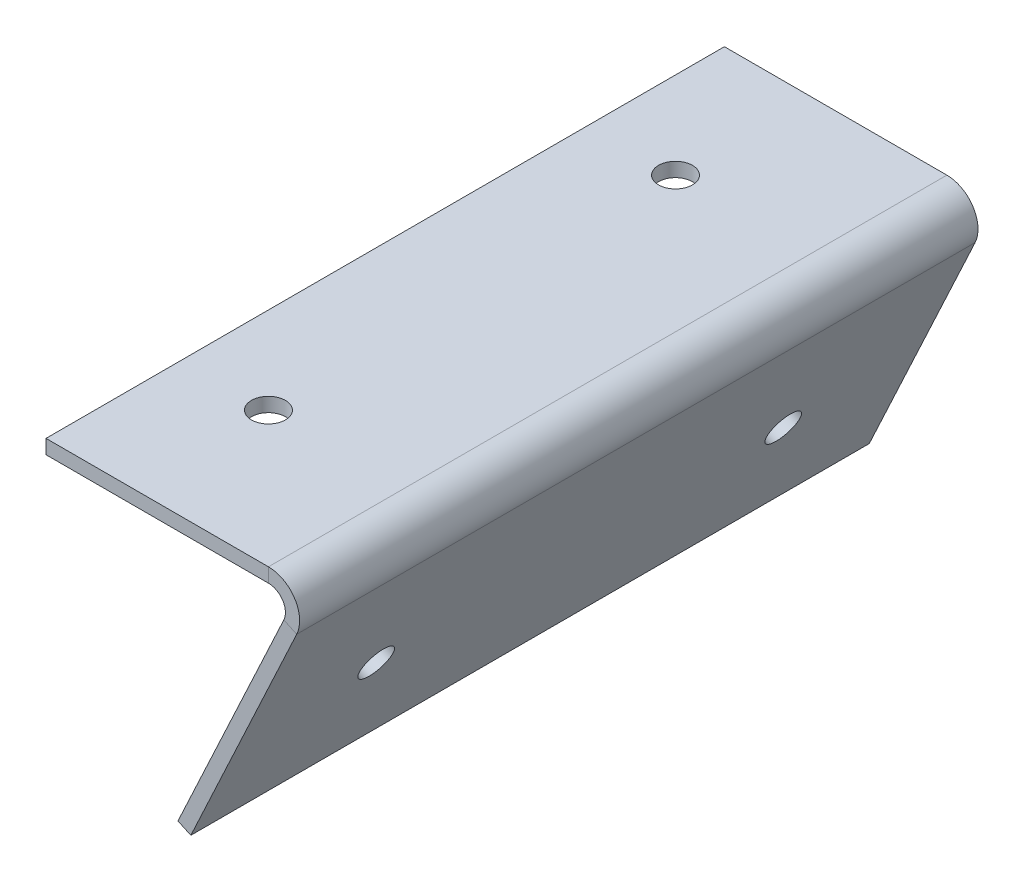
ISO-10303-21;
HEADER;
FILE_DESCRIPTION(('STEP AP214'),'2;1');
FILE_NAME('part.step','',(''),(''),'','','');
FILE_SCHEMA(('AUTOMOTIVE_DESIGN { 1 0 10303 214 1 1 1 1 }'));
ENDSEC;
DATA;
#1=APPLICATION_CONTEXT('core data for automotive mechanical design processes');
#2=APPLICATION_PROTOCOL_DEFINITION('international standard','automotive_design',2000,#1);
#3=PRODUCT_CONTEXT('',#1,'mechanical');
#4=PRODUCT('Part','Part','',(#3));
#5=PRODUCT_RELATED_PRODUCT_CATEGORY('part','',(#4));
#6=PRODUCT_DEFINITION_FORMATION('','',#4);
#7=PRODUCT_DEFINITION_CONTEXT('part definition',#1,'design');
#8=PRODUCT_DEFINITION('design','',#6,#7);
#9=PRODUCT_DEFINITION_SHAPE('','',#8);
#10=(LENGTH_UNIT() NAMED_UNIT(*) SI_UNIT(.MILLI.,.METRE.));
#11=(NAMED_UNIT(*) PLANE_ANGLE_UNIT() SI_UNIT($,.RADIAN.));
#12=(NAMED_UNIT(*) SI_UNIT($,.STERADIAN.) SOLID_ANGLE_UNIT());
#13=UNCERTAINTY_MEASURE_WITH_UNIT(LENGTH_MEASURE(1.E-05),#10,'distance_accuracy_value','');
#14=(GEOMETRIC_REPRESENTATION_CONTEXT(3) GLOBAL_UNCERTAINTY_ASSIGNED_CONTEXT((#13)) GLOBAL_UNIT_ASSIGNED_CONTEXT((#10,
#11,#12)) REPRESENTATION_CONTEXT('',''));
#15=CARTESIAN_POINT('',(0.,0.,0.));
#16=DIRECTION('',(0.,0.,1.));
#17=DIRECTION('',(1.,0.,0.));
#18=AXIS2_PLACEMENT_3D('',#15,#16,#17);
#19=CARTESIAN_POINT('',(46.9312868686949,-8.29648208354991,127.));
#20=DIRECTION('',(0.,0.,1.));
#21=DIRECTION('',(1.,0.,0.));
#22=AXIS2_PLACEMENT_3D('',#19,#20,#21);
#23=PLANE('',#22);
#24=DIRECTION('',(-0.906307787036648,0.422618261740704,0.));
#25=VECTOR('',#24,1.);
#26=CARTESIAN_POINT('',(46.9312868686949,-8.29648208354991,127.));
#27=LINE('',#26,#25);
#28=CARTESIAN_POINT('',(46.9312868686949,-8.29648208354991,127.));
#29=VERTEX_POINT('',#28);
#30=CARTESIAN_POINT('',(44.5233720877844,-7.17365298102673,127.));
#31=VERTEX_POINT('',#30);
#32=EDGE_CURVE('E13',#29,#31,#27,.T.);
#33=ORIENTED_EDGE('',*,*,#32,.F.);
#34=CARTESIAN_POINT('',(41.6458448639431,-5.83184,127.));
#35=DIRECTION('',(0.,0.,1.));
#36=DIRECTION('',(1.,0.,0.));
#37=AXIS2_PLACEMENT_3D('',#34,#35,#36);
#38=CIRCLE('',#37,5.83184);
#39=CARTESIAN_POINT('',(41.6458448639431,0.,127.));
#40=VERTEX_POINT('',#39);
#41=EDGE_CURVE('E150',#40,#29,#38,.F.);
#42=ORIENTED_EDGE('',*,*,#41,.F.);
#43=DIRECTION('',(0.,1.,0.));
#44=VECTOR('',#43,1.);
#45=CARTESIAN_POINT('',(41.6458448639431,-2.65684,127.));
#46=LINE('',#45,#44);
#47=CARTESIAN_POINT('',(41.6458448639431,-2.65684,127.));
#48=VERTEX_POINT('',#47);
#49=EDGE_CURVE('E61',#48,#40,#46,.T.);
#50=ORIENTED_EDGE('',*,*,#49,.F.);
#51=CARTESIAN_POINT('',(41.6458448639431,-5.83184,127.));
#52=DIRECTION('',(0.,0.,1.));
#53=DIRECTION('',(1.,0.,0.));
#54=AXIS2_PLACEMENT_3D('',#51,#52,#53);
#55=CIRCLE('',#54,3.175);
#56=EDGE_CURVE('E143',#48,#31,#55,.F.);
#57=ORIENTED_EDGE('',*,*,#56,.T.);
#58=EDGE_LOOP('',(#33,#42,#50,#57));
#59=FACE_BOUND('',#58,.T.);
#60=ADVANCED_FACE('F53',(#59),#23,.T.);
#61=CARTESIAN_POINT('',(41.6458448639431,-2.65684,127.));
#62=DIRECTION('',(0.,0.,1.));
#63=DIRECTION('',(1.,0.,0.));
#64=AXIS2_PLACEMENT_3D('',#61,#62,#63);
#65=PLANE('',#64);
#66=DIRECTION('',(-0.422618261740704,-0.906307787036648,0.));
#67=VECTOR('',#66,1.);
#68=CARTESIAN_POINT('',(50.8,0.,127.));
#69=LINE('',#68,#67);
#70=CARTESIAN_POINT('',(27.1115709657258,-50.8,127.));
#71=VERTEX_POINT('',#70);
#72=EDGE_CURVE('E200',#29,#71,#69,.T.);
#73=ORIENTED_EDGE('',*,*,#72,.F.);
#74=ORIENTED_EDGE('',*,*,#32,.T.);
#75=DIRECTION('',(-0.422618261740704,-0.906307787036648,0.));
#76=VECTOR('',#75,1.);
#77=CARTESIAN_POINT('',(48.3920852190896,1.12282910252317,127.));
#78=LINE('',#77,#76);
#79=CARTESIAN_POINT('',(24.7036561848153,-49.6771708974768,127.));
#80=VERTEX_POINT('',#79);
#81=EDGE_CURVE('E109',#31,#80,#78,.T.);
#82=ORIENTED_EDGE('',*,*,#81,.T.);
#83=DIRECTION('',(-0.906307787036649,0.422618261740701,0.));
#84=VECTOR('',#83,1.);
#85=CARTESIAN_POINT('',(27.1115709657258,-50.8,127.));
#86=LINE('',#85,#84);
#87=EDGE_CURVE('E432',#71,#80,#86,.T.);
#88=ORIENTED_EDGE('',*,*,#87,.F.);
#89=EDGE_LOOP('',(#73,#74,#82,#88));
#90=FACE_BOUND('',#89,.T.);
#91=ADVANCED_FACE('F208',(#90),#65,.T.);
#92=CARTESIAN_POINT('',(41.6458448639431,0.,0.));
#93=DIRECTION('',(0.,0.,-1.));
#94=DIRECTION('',(-1.,0.,0.));
#95=AXIS2_PLACEMENT_3D('',#92,#93,#94);
#96=PLANE('',#95);
#97=DIRECTION('',(0.,-1.,0.));
#98=VECTOR('',#97,1.);
#99=CARTESIAN_POINT('',(41.6458448639431,0.,0.));
#100=LINE('',#99,#98);
#101=CARTESIAN_POINT('',(41.6458448639431,0.,0.));
#102=VERTEX_POINT('',#101);
#103=CARTESIAN_POINT('',(41.6458448639431,-2.65684,0.));
#104=VERTEX_POINT('',#103);
#105=EDGE_CURVE('E96',#102,#104,#100,.T.);
#106=ORIENTED_EDGE('',*,*,#105,.F.);
#107=CARTESIAN_POINT('',(41.6458448639431,-5.83184,0.));
#108=DIRECTION('',(0.,0.,1.));
#109=DIRECTION('',(1.,0.,0.));
#110=AXIS2_PLACEMENT_3D('',#107,#108,#109);
#111=CIRCLE('',#110,5.83184);
#112=CARTESIAN_POINT('',(46.9312868686949,-8.29648208354991,0.));
#113=VERTEX_POINT('',#112);
#114=EDGE_CURVE('E166',#102,#113,#111,.F.);
#115=ORIENTED_EDGE('',*,*,#114,.T.);
#116=DIRECTION('',(0.906307787036648,-0.422618261740704,0.));
#117=VECTOR('',#116,1.);
#118=CARTESIAN_POINT('',(44.5233720877844,-7.17365298102673,0.));
#119=LINE('',#118,#117);
#120=CARTESIAN_POINT('',(44.5233720877844,-7.17365298102673,0.));
#121=VERTEX_POINT('',#120);
#122=EDGE_CURVE('E103',#121,#113,#119,.T.);
#123=ORIENTED_EDGE('',*,*,#122,.F.);
#124=CARTESIAN_POINT('',(41.6458448639431,-5.83184,0.));
#125=DIRECTION('',(0.,0.,1.));
#126=DIRECTION('',(1.,0.,0.));
#127=AXIS2_PLACEMENT_3D('',#124,#125,#126);
#128=CIRCLE('',#127,3.175);
#129=EDGE_CURVE('E173',#104,#121,#128,.F.);
#130=ORIENTED_EDGE('',*,*,#129,.F.);
#131=EDGE_LOOP('',(#106,#115,#123,#130));
#132=FACE_BOUND('',#131,.T.);
#133=ADVANCED_FACE('F206',(#132),#96,.T.);
#134=CARTESIAN_POINT('',(44.5233720877844,-7.17365298102673,0.));
#135=DIRECTION('',(0.,0.,-1.));
#136=DIRECTION('',(-1.,0.,0.));
#137=AXIS2_PLACEMENT_3D('',#134,#135,#136);
#138=PLANE('',#137);
#139=DIRECTION('',(1.,0.,0.));
#140=VECTOR('',#139,1.);
#141=CARTESIAN_POINT('',(0.,0.,0.));
#142=LINE('',#141,#140);
#143=CARTESIAN_POINT('',(0.,0.,0.));
#144=VERTEX_POINT('',#143);
#145=EDGE_CURVE('E168',#144,#102,#142,.T.);
#146=ORIENTED_EDGE('',*,*,#145,.T.);
#147=ORIENTED_EDGE('',*,*,#105,.T.);
#148=DIRECTION('',(1.,0.,0.));
#149=VECTOR('',#148,1.);
#150=CARTESIAN_POINT('',(0.,-2.65684,0.));
#151=LINE('',#150,#149);
#152=CARTESIAN_POINT('',(0.,-2.65684,0.));
#153=VERTEX_POINT('',#152);
#154=EDGE_CURVE('E171',#153,#104,#151,.T.);
#155=ORIENTED_EDGE('',*,*,#154,.F.);
#156=DIRECTION('',(0.,1.,0.));
#157=VECTOR('',#156,1.);
#158=CARTESIAN_POINT('',(0.,-2.65684,0.));
#159=LINE('',#158,#157);
#160=EDGE_CURVE('E131',#153,#144,#159,.T.);
#161=ORIENTED_EDGE('',*,*,#160,.T.);
#162=EDGE_LOOP('',(#146,#147,#155,#161));
#163=FACE_BOUND('',#162,.T.);
#164=ADVANCED_FACE('F202',(#163),#138,.T.);
#165=CARTESIAN_POINT('',(48.3920852190896,1.12282910252317,127.));
#166=DIRECTION('',(0.906307787036648,-0.422618261740704,0.));
#167=DIRECTION('',(0.422618261740704,0.906307787036648,0.));
#168=AXIS2_PLACEMENT_3D('',#165,#166,#167);
#169=PLANE('',#168);
#170=CARTESIAN_POINT('',(34.0022603893707,-29.7362498297288,101.6));
#171=DIRECTION('',(0.906307787036648,-0.422618261740704,0.));
#172=DIRECTION('',(0.422618261740704,0.906307787036648,0.));
#173=AXIS2_PLACEMENT_3D('',#170,#171,#172);
#174=CIRCLE('',#173,3.175);
#175=CARTESIAN_POINT('',(35.3440733703974,-26.8587226058874,101.6));
#176=VERTEX_POINT('',#175);
#177=EDGE_CURVE('E410',#176,#176,#174,.F.);
#178=ORIENTED_EDGE('',*,*,#177,.F.);
#179=EDGE_LOOP('',(#178));
#180=FACE_BOUND('',#179,.T.);
#181=CARTESIAN_POINT('',(34.0022603893707,-29.7362498297288,25.4));
#182=DIRECTION('',(0.906307787036648,-0.422618261740704,0.));
#183=DIRECTION('',(0.422618261740704,0.906307787036648,0.));
#184=AXIS2_PLACEMENT_3D('',#181,#182,#183);
#185=CIRCLE('',#184,3.175);
#186=CARTESIAN_POINT('',(35.3440733703974,-26.8587226058874,25.4));
#187=VERTEX_POINT('',#186);
#188=EDGE_CURVE('E416',#187,#187,#185,.F.);
#189=ORIENTED_EDGE('',*,*,#188,.F.);
#190=EDGE_LOOP('',(#189));
#191=FACE_BOUND('',#190,.T.);
#192=DIRECTION('',(-0.422618261740704,-0.906307787036648,0.));
#193=VECTOR('',#192,1.);
#194=CARTESIAN_POINT('',(48.3920852190896,1.12282910252317,0.));
#195=LINE('',#194,#193);
#196=CARTESIAN_POINT('',(24.7036561848153,-49.6771708974768,0.));
#197=VERTEX_POINT('',#196);
#198=EDGE_CURVE('E156',#121,#197,#195,.T.);
#199=ORIENTED_EDGE('',*,*,#198,.T.);
#200=DIRECTION('',(0.,0.,-1.));
#201=VECTOR('',#200,1.);
#202=CARTESIAN_POINT('',(24.7036561848153,-49.6771708974768,127.));
#203=LINE('',#202,#201);
#204=EDGE_CURVE('E187',#80,#197,#203,.T.);
#205=ORIENTED_EDGE('',*,*,#204,.F.);
#206=ORIENTED_EDGE('',*,*,#81,.F.);
#207=DIRECTION('',(0.,0.,-1.));
#208=VECTOR('',#207,1.);
#209=CARTESIAN_POINT('',(44.5233720877844,-7.17365298102673,127.));
#210=LINE('',#209,#208);
#211=EDGE_CURVE('E155',#31,#121,#210,.T.);
#212=ORIENTED_EDGE('',*,*,#211,.T.);
#213=EDGE_LOOP('',(#199,#205,#206,#212));
#214=FACE_BOUND('',#213,.T.);
#215=ADVANCED_FACE('F214',(#180,#191,#214),#169,.F.);
#216=CARTESIAN_POINT('',(27.1115709657258,-50.8,127.));
#217=DIRECTION('',(-0.422618261740701,-0.906307787036649,0.));
#218=DIRECTION('',(0.906307787036649,-0.422618261740701,0.));
#219=AXIS2_PLACEMENT_3D('',#216,#217,#218);
#220=PLANE('',#219);
#221=DIRECTION('',(-0.906307787036649,0.422618261740701,0.));
#222=VECTOR('',#221,1.);
#223=CARTESIAN_POINT('',(27.1115709657258,-50.8,0.));
#224=LINE('',#223,#222);
#225=CARTESIAN_POINT('',(27.1115709657258,-50.8,0.));
#226=VERTEX_POINT('',#225);
#227=EDGE_CURVE('E159',#226,#197,#224,.T.);
#228=ORIENTED_EDGE('',*,*,#227,.F.);
#229=DIRECTION('',(0.,0.,-1.));
#230=VECTOR('',#229,1.);
#231=CARTESIAN_POINT('',(27.1115709657258,-50.8,127.));
#232=LINE('',#231,#230);
#233=EDGE_CURVE('E185',#71,#226,#232,.T.);
#234=ORIENTED_EDGE('',*,*,#233,.F.);
#235=ORIENTED_EDGE('',*,*,#87,.T.);
#236=ORIENTED_EDGE('',*,*,#204,.T.);
#237=EDGE_LOOP('',(#228,#234,#235,#236));
#238=FACE_BOUND('',#237,.T.);
#239=ADVANCED_FACE('F243',(#238),#220,.T.);
#240=CARTESIAN_POINT('',(50.8,0.,127.));
#241=DIRECTION('',(0.906307787036648,-0.422618261740704,0.));
#242=DIRECTION('',(0.422618261740704,0.906307787036648,0.));
#243=AXIS2_PLACEMENT_3D('',#240,#241,#242);
#244=PLANE('',#243);
#245=CARTESIAN_POINT('',(36.4101751702812,-30.859078932252,101.6));
#246=DIRECTION('',(0.906307787036648,-0.422618261740704,0.));
#247=DIRECTION('',(0.422618261740704,0.906307787036648,0.));
#248=AXIS2_PLACEMENT_3D('',#245,#246,#247);
#249=CIRCLE('',#248,3.175);
#250=CARTESIAN_POINT('',(37.7519881513079,-27.9815517084106,101.6));
#251=VERTEX_POINT('',#250);
#252=EDGE_CURVE('E407',#251,#251,#249,.T.);
#253=ORIENTED_EDGE('',*,*,#252,.F.);
#254=EDGE_LOOP('',(#253));
#255=FACE_BOUND('',#254,.T.);
#256=CARTESIAN_POINT('',(36.4101751702812,-30.859078932252,25.4));
#257=DIRECTION('',(0.906307787036648,-0.422618261740704,0.));
#258=DIRECTION('',(0.422618261740704,0.906307787036648,0.));
#259=AXIS2_PLACEMENT_3D('',#256,#257,#258);
#260=CIRCLE('',#259,3.175);
#261=CARTESIAN_POINT('',(37.7519881513079,-27.9815517084106,25.4));
#262=VERTEX_POINT('',#261);
#263=EDGE_CURVE('E419',#262,#262,#260,.T.);
#264=ORIENTED_EDGE('',*,*,#263,.F.);
#265=EDGE_LOOP('',(#264));
#266=FACE_BOUND('',#265,.T.);
#267=DIRECTION('',(-0.422618261740704,-0.906307787036648,0.));
#268=VECTOR('',#267,1.);
#269=CARTESIAN_POINT('',(50.8,0.,0.));
#270=LINE('',#269,#268);
#271=EDGE_CURVE('E163',#113,#226,#270,.T.);
#272=ORIENTED_EDGE('',*,*,#271,.F.);
#273=DIRECTION('',(0.,0.,-1.));
#274=VECTOR('',#273,1.);
#275=CARTESIAN_POINT('',(46.9312868686949,-8.29648208354991,127.));
#276=LINE('',#275,#274);
#277=EDGE_CURVE('E182',#29,#113,#276,.T.);
#278=ORIENTED_EDGE('',*,*,#277,.F.);
#279=ORIENTED_EDGE('',*,*,#72,.T.);
#280=ORIENTED_EDGE('',*,*,#233,.T.);
#281=EDGE_LOOP('',(#272,#278,#279,#280));
#282=FACE_BOUND('',#281,.T.);
#283=ADVANCED_FACE('F248',(#255,#266,#282),#244,.T.);
#284=CARTESIAN_POINT('',(41.6458448639431,-5.83184,127.));
#285=DIRECTION('',(0.,0.,-1.));
#286=DIRECTION('',(-1.,0.,0.));
#287=AXIS2_PLACEMENT_3D('',#284,#285,#286);
#288=CYLINDRICAL_SURFACE('',#287,5.83184);
#289=ORIENTED_EDGE('',*,*,#114,.F.);
#290=DIRECTION('',(0.,0.,-1.));
#291=VECTOR('',#290,1.);
#292=CARTESIAN_POINT('',(41.6458448639431,0.,127.));
#293=LINE('',#292,#291);
#294=EDGE_CURVE('E179',#40,#102,#293,.T.);
#295=ORIENTED_EDGE('',*,*,#294,.F.);
#296=ORIENTED_EDGE('',*,*,#41,.T.);
#297=ORIENTED_EDGE('',*,*,#277,.T.);
#298=EDGE_LOOP('',(#289,#295,#296,#297));
#299=FACE_BOUND('',#298,.T.);
#300=ADVANCED_FACE('F196',(#299),#288,.T.);
#301=CARTESIAN_POINT('',(0.,0.,127.));
#302=DIRECTION('',(0.,1.,0.));
#303=DIRECTION('',(0.,0.,1.));
#304=AXIS2_PLACEMENT_3D('',#301,#302,#303);
#305=PLANE('',#304);
#306=CARTESIAN_POINT('',(16.2458448639431,0.,101.6));
#307=DIRECTION('',(0.,1.,0.));
#308=DIRECTION('',(0.,0.,1.));
#309=AXIS2_PLACEMENT_3D('',#306,#307,#308);
#310=CIRCLE('',#309,3.175);
#311=CARTESIAN_POINT('',(16.2458448639431,0.,104.775));
#312=VERTEX_POINT('',#311);
#313=EDGE_CURVE('E424',#312,#312,#310,.T.);
#314=ORIENTED_EDGE('',*,*,#313,.F.);
#315=EDGE_LOOP('',(#314));
#316=FACE_BOUND('',#315,.T.);
#317=CARTESIAN_POINT('',(16.2458448639431,0.,25.4));
#318=DIRECTION('',(0.,1.,0.));
#319=DIRECTION('',(0.,0.,1.));
#320=AXIS2_PLACEMENT_3D('',#317,#318,#319);
#321=CIRCLE('',#320,3.175);
#322=CARTESIAN_POINT('',(16.2458448639431,0.,28.575));
#323=VERTEX_POINT('',#322);
#324=EDGE_CURVE('E411',#323,#323,#321,.T.);
#325=ORIENTED_EDGE('',*,*,#324,.F.);
#326=EDGE_LOOP('',(#325));
#327=FACE_BOUND('',#326,.T.);
#328=ORIENTED_EDGE('',*,*,#145,.F.);
#329=DIRECTION('',(0.,0.,-1.));
#330=VECTOR('',#329,1.);
#331=CARTESIAN_POINT('',(0.,0.,127.));
#332=LINE('',#331,#330);
#333=CARTESIAN_POINT('',(0.,0.,127.));
#334=VERTEX_POINT('',#333);
#335=EDGE_CURVE('E133',#334,#144,#332,.T.);
#336=ORIENTED_EDGE('',*,*,#335,.F.);
#337=DIRECTION('',(1.,0.,0.));
#338=VECTOR('',#337,1.);
#339=CARTESIAN_POINT('',(0.,0.,127.));
#340=LINE('',#339,#338);
#341=EDGE_CURVE('E148',#334,#40,#340,.T.);
#342=ORIENTED_EDGE('',*,*,#341,.T.);
#343=ORIENTED_EDGE('',*,*,#294,.T.);
#344=EDGE_LOOP('',(#328,#336,#342,#343));
#345=FACE_BOUND('',#344,.T.);
#346=ADVANCED_FACE('F201',(#316,#327,#345),#305,.T.);
#347=CARTESIAN_POINT('',(0.,-2.65684,127.));
#348=DIRECTION('',(-1.,0.,0.));
#349=DIRECTION('',(0.,0.,1.));
#350=AXIS2_PLACEMENT_3D('',#347,#348,#349);
#351=PLANE('',#350);
#352=ORIENTED_EDGE('',*,*,#160,.F.);
#353=DIRECTION('',(0.,0.,-1.));
#354=VECTOR('',#353,1.);
#355=CARTESIAN_POINT('',(0.,-2.65684,127.));
#356=LINE('',#355,#354);
#357=CARTESIAN_POINT('',(0.,-2.65684,127.));
#358=VERTEX_POINT('',#357);
#359=EDGE_CURVE('E125',#358,#153,#356,.T.);
#360=ORIENTED_EDGE('',*,*,#359,.F.);
#361=DIRECTION('',(0.,1.,0.));
#362=VECTOR('',#361,1.);
#363=CARTESIAN_POINT('',(0.,-2.65684,127.));
#364=LINE('',#363,#362);
#365=EDGE_CURVE('E129',#358,#334,#364,.T.);
#366=ORIENTED_EDGE('',*,*,#365,.T.);
#367=ORIENTED_EDGE('',*,*,#335,.T.);
#368=EDGE_LOOP('',(#352,#360,#366,#367));
#369=FACE_BOUND('',#368,.T.);
#370=ADVANCED_FACE('F127',(#369),#351,.T.);
#371=CARTESIAN_POINT('',(0.,-2.65684,127.));
#372=DIRECTION('',(0.,1.,0.));
#373=DIRECTION('',(0.,0.,1.));
#374=AXIS2_PLACEMENT_3D('',#371,#372,#373);
#375=PLANE('',#374);
#376=CARTESIAN_POINT('',(16.2458448639431,-2.65684,101.6));
#377=DIRECTION('',(0.,1.,0.));
#378=DIRECTION('',(0.,0.,1.));
#379=AXIS2_PLACEMENT_3D('',#376,#377,#378);
#380=CIRCLE('',#379,3.175);
#381=CARTESIAN_POINT('',(16.2458448639431,-2.65684,104.775));
#382=VERTEX_POINT('',#381);
#383=EDGE_CURVE('E160',#382,#382,#380,.F.);
#384=ORIENTED_EDGE('',*,*,#383,.F.);
#385=EDGE_LOOP('',(#384));
#386=FACE_BOUND('',#385,.T.);
#387=CARTESIAN_POINT('',(16.2458448639431,-2.65684,25.4));
#388=DIRECTION('',(0.,1.,0.));
#389=DIRECTION('',(0.,0.,1.));
#390=AXIS2_PLACEMENT_3D('',#387,#388,#389);
#391=CIRCLE('',#390,3.175);
#392=CARTESIAN_POINT('',(16.2458448639431,-2.65684,28.575));
#393=VERTEX_POINT('',#392);
#394=EDGE_CURVE('E414',#393,#393,#391,.F.);
#395=ORIENTED_EDGE('',*,*,#394,.F.);
#396=EDGE_LOOP('',(#395));
#397=FACE_BOUND('',#396,.T.);
#398=ORIENTED_EDGE('',*,*,#154,.T.);
#399=DIRECTION('',(0.,0.,-1.));
#400=VECTOR('',#399,1.);
#401=CARTESIAN_POINT('',(41.6458448639431,-2.65684,127.));
#402=LINE('',#401,#400);
#403=EDGE_CURVE('E134',#48,#104,#402,.T.);
#404=ORIENTED_EDGE('',*,*,#403,.F.);
#405=DIRECTION('',(1.,0.,0.));
#406=VECTOR('',#405,1.);
#407=CARTESIAN_POINT('',(0.,-2.65684,127.));
#408=LINE('',#407,#406);
#409=EDGE_CURVE('E138',#358,#48,#408,.T.);
#410=ORIENTED_EDGE('',*,*,#409,.F.);
#411=ORIENTED_EDGE('',*,*,#359,.T.);
#412=EDGE_LOOP('',(#398,#404,#410,#411));
#413=FACE_BOUND('',#412,.T.);
#414=ADVANCED_FACE('F139',(#386,#397,#413),#375,.F.);
#415=CARTESIAN_POINT('',(41.6458448639431,-5.83184,127.));
#416=DIRECTION('',(0.,0.,-1.));
#417=DIRECTION('',(-1.,0.,0.));
#418=AXIS2_PLACEMENT_3D('',#415,#416,#417);
#419=CYLINDRICAL_SURFACE('',#418,3.175);
#420=ORIENTED_EDGE('',*,*,#129,.T.);
#421=ORIENTED_EDGE('',*,*,#211,.F.);
#422=ORIENTED_EDGE('',*,*,#56,.F.);
#423=ORIENTED_EDGE('',*,*,#403,.T.);
#424=EDGE_LOOP('',(#420,#421,#422,#423));
#425=FACE_BOUND('',#424,.T.);
#426=ADVANCED_FACE('F204',(#425),#419,.F.);
#427=CARTESIAN_POINT('',(41.6458448639431,-5.83184,127.));
#428=DIRECTION('',(0.,0.,1.));
#429=DIRECTION('',(1.,0.,0.));
#430=AXIS2_PLACEMENT_3D('',#427,#428,#429);
#431=PLANE('',#430);
#432=ORIENTED_EDGE('',*,*,#409,.T.);
#433=ORIENTED_EDGE('',*,*,#49,.T.);
#434=ORIENTED_EDGE('',*,*,#341,.F.);
#435=ORIENTED_EDGE('',*,*,#365,.F.);
#436=EDGE_LOOP('',(#432,#433,#434,#435));
#437=FACE_BOUND('',#436,.T.);
#438=ADVANCED_FACE('F146',(#437),#431,.T.);
#439=CARTESIAN_POINT('',(41.6458448639431,-5.83184,0.));
#440=DIRECTION('',(0.,0.,1.));
#441=DIRECTION('',(1.,0.,0.));
#442=AXIS2_PLACEMENT_3D('',#439,#440,#441);
#443=PLANE('',#442);
#444=ORIENTED_EDGE('',*,*,#198,.F.);
#445=ORIENTED_EDGE('',*,*,#122,.T.);
#446=ORIENTED_EDGE('',*,*,#271,.T.);
#447=ORIENTED_EDGE('',*,*,#227,.T.);
#448=EDGE_LOOP('',(#444,#445,#446,#447));
#449=FACE_BOUND('',#448,.T.);
#450=ADVANCED_FACE('F292',(#449),#443,.F.);
#451=CARTESIAN_POINT('',(16.2458448639431,-50.801,25.4));
#452=DIRECTION('',(0.,1.,0.));
#453=DIRECTION('',(0.,0.,1.));
#454=AXIS2_PLACEMENT_3D('',#451,#452,#453);
#455=CYLINDRICAL_SURFACE('',#454,3.175);
#456=ORIENTED_EDGE('',*,*,#324,.T.);
#457=EDGE_LOOP('',(#456));
#458=FACE_BOUND('',#457,.T.);
#459=ORIENTED_EDGE('',*,*,#394,.T.);
#460=EDGE_LOOP('',(#459));
#461=FACE_BOUND('',#460,.T.);
#462=ADVANCED_FACE('F302',(#458,#461),#455,.F.);
#463=CARTESIAN_POINT('',(16.2458448639431,-50.801,101.6));
#464=DIRECTION('',(0.,1.,0.));
#465=DIRECTION('',(0.,0.,1.));
#466=AXIS2_PLACEMENT_3D('',#463,#464,#465);
#467=CYLINDRICAL_SURFACE('',#466,3.175);
#468=ORIENTED_EDGE('',*,*,#313,.T.);
#469=EDGE_LOOP('',(#468));
#470=FACE_BOUND('',#469,.T.);
#471=ORIENTED_EDGE('',*,*,#383,.T.);
#472=EDGE_LOOP('',(#471));
#473=FACE_BOUND('',#472,.T.);
#474=ADVANCED_FACE('F329',(#470,#473),#467,.F.);
#475=CARTESIAN_POINT('',(-5.31783453178318,-11.4009884486131,25.4));
#476=DIRECTION('',(0.906307787036648,-0.422618261740704,0.));
#477=DIRECTION('',(0.422618261740704,0.906307787036648,0.));
#478=AXIS2_PLACEMENT_3D('',#475,#476,#477);
#479=CYLINDRICAL_SURFACE('',#478,3.175);
#480=ORIENTED_EDGE('',*,*,#263,.T.);
#481=EDGE_LOOP('',(#480));
#482=FACE_BOUND('',#481,.T.);
#483=ORIENTED_EDGE('',*,*,#188,.T.);
#484=EDGE_LOOP('',(#483));
#485=FACE_BOUND('',#484,.T.);
#486=ADVANCED_FACE('F340',(#482,#485),#479,.F.);
#487=CARTESIAN_POINT('',(-5.31783453178318,-11.4009884486131,101.6));
#488=DIRECTION('',(0.906307787036648,-0.422618261740704,0.));
#489=DIRECTION('',(0.422618261740704,0.906307787036648,0.));
#490=AXIS2_PLACEMENT_3D('',#487,#488,#489);
#491=CYLINDRICAL_SURFACE('',#490,3.175);
#492=ORIENTED_EDGE('',*,*,#252,.T.);
#493=EDGE_LOOP('',(#492));
#494=FACE_BOUND('',#493,.T.);
#495=ORIENTED_EDGE('',*,*,#177,.T.);
#496=EDGE_LOOP('',(#495));
#497=FACE_BOUND('',#496,.T.);
#498=ADVANCED_FACE('F367',(#494,#497),#491,.F.);
#499=CLOSED_SHELL('',(#60,#91,#133,#164,#215,#239,#283,#300,#346,#370,#414,#426,#438,#450,#462,
#474,#486,#498));
#500=MANIFOLD_SOLID_BREP('B2',#499);
#501=ADVANCED_BREP_SHAPE_REPRESENTATION('',(#18,#500),#14);
#502=SHAPE_DEFINITION_REPRESENTATION(#9,#501);
ENDSEC;
END-ISO-10303-21;
